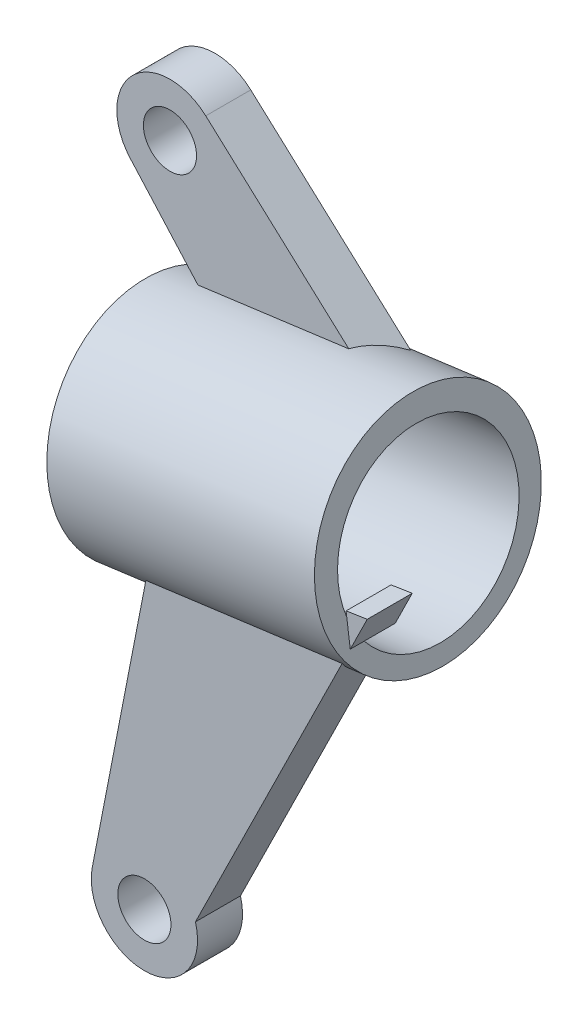
ISO-10303-21;
HEADER;
FILE_DESCRIPTION(('STEP AP214'),'2;1');
FILE_NAME('part.step','',(''),(''),'','','');
FILE_SCHEMA(('AUTOMOTIVE_DESIGN { 1 0 10303 214 1 1 1 1 }'));
ENDSEC;
DATA;
#1=APPLICATION_CONTEXT('core data for automotive mechanical design processes');
#2=APPLICATION_PROTOCOL_DEFINITION('international standard','automotive_design',2000,#1);
#3=PRODUCT_CONTEXT('',#1,'mechanical');
#4=PRODUCT('Part','Part','',(#3));
#5=PRODUCT_RELATED_PRODUCT_CATEGORY('part','',(#4));
#6=PRODUCT_DEFINITION_FORMATION('','',#4);
#7=PRODUCT_DEFINITION_CONTEXT('part definition',#1,'design');
#8=PRODUCT_DEFINITION('design','',#6,#7);
#9=PRODUCT_DEFINITION_SHAPE('','',#8);
#10=(LENGTH_UNIT() NAMED_UNIT(*) SI_UNIT(.MILLI.,.METRE.));
#11=(NAMED_UNIT(*) PLANE_ANGLE_UNIT() SI_UNIT($,.RADIAN.));
#12=(NAMED_UNIT(*) SI_UNIT($,.STERADIAN.) SOLID_ANGLE_UNIT());
#13=UNCERTAINTY_MEASURE_WITH_UNIT(LENGTH_MEASURE(1.E-05),#10,'distance_accuracy_value','');
#14=(GEOMETRIC_REPRESENTATION_CONTEXT(3) GLOBAL_UNCERTAINTY_ASSIGNED_CONTEXT((#13)) GLOBAL_UNIT_ASSIGNED_CONTEXT((#10,
#11,#12)) REPRESENTATION_CONTEXT('',''));
#15=CARTESIAN_POINT('',(0.,0.,0.));
#16=DIRECTION('',(0.,0.,1.));
#17=DIRECTION('',(1.,0.,0.));
#18=AXIS2_PLACEMENT_3D('',#15,#16,#17);
#19=CARTESIAN_POINT('',(81.8559870222354,35.5808890120292,0.));
#20=DIRECTION('',(-0.991210163402101,-0.132296681622706,0.));
#21=DIRECTION('',(0.132296681622706,-0.991210163402101,0.));
#22=AXIS2_PLACEMENT_3D('',#19,#20,#21);
#23=CYLINDRICAL_SURFACE('',#22,6.35);
#24=CARTESIAN_POINT('',(97.5954702150163,37.6816356283818,0.));
#25=DIRECTION('',(0.673198597584903,0.739461728698464,0.));
#26=DIRECTION('',(-0.739461728698464,0.673198597584903,0.));
#27=AXIS2_PLACEMENT_3D('',#24,#25,#26);
#28=ELLIPSE('',#27,8.29946427819877,6.35);
#29=CARTESIAN_POINT('',(91.5302630818505,43.2033398324599,-0.96935265499751));
#30=VERTEX_POINT('',#29);
#31=CARTESIAN_POINT('',(92.4807144852347,42.3380583351239,-3.50935265499751));
#32=VERTEX_POINT('',#31);
#33=EDGE_CURVE('E223',#30,#32,#28,.F.);
#34=ORIENTED_EDGE('',*,*,#33,.F.);
#35=DIRECTION('',(-0.991210163402101,-0.132296681622706,0.));
#36=VECTOR('',#35,1.);
#37=CARTESIAN_POINT('',(81.0257491284776,41.8013038269767,-0.96935265499751));
#38=LINE('',#37,#36);
#39=CARTESIAN_POINT('',(83.0122910436959,42.0664472980502,-0.96935265499751));
#40=VERTEX_POINT('',#39);
#41=EDGE_CURVE('E217',#30,#40,#38,.T.);
#42=ORIENTED_EDGE('',*,*,#41,.T.);
#43=CARTESIAN_POINT('',(88.0638021611543,36.4094452287929,0.));
#44=DIRECTION('',(0.745897281645723,0.666060992127238,0.));
#45=DIRECTION('',(-0.666060992127238,0.745897281645723,0.));
#46=AXIS2_PLACEMENT_3D('',#43,#44,#45);
#47=ELLIPSE('',#46,7.6740997130083,6.35);
#48=CARTESIAN_POINT('',(83.8038906915538,41.1799638791621,-3.50935265499751));
#49=VERTEX_POINT('',#48);
#50=EDGE_CURVE('E221',#40,#49,#47,.F.);
#51=ORIENTED_EDGE('',*,*,#50,.T.);
#52=DIRECTION('',(-0.991210163402101,-0.132296681622706,0.));
#53=VECTOR('',#52,1.);
#54=CARTESIAN_POINT('',(81.1558519846439,40.8265305239893,-3.50935265499751));
#55=LINE('',#54,#53);
#56=EDGE_CURVE('E188',#32,#49,#55,.T.);
#57=ORIENTED_EDGE('',*,*,#56,.F.);
#58=EDGE_LOOP('',(#34,#42,#51,#57));
#59=FACE_BOUND('',#58,.T.);
#60=CARTESIAN_POINT('',(96.9620299124834,37.5970904399592,0.));
#61=DIRECTION('',(-0.991210163402101,-0.132296681622706,0.));
#62=DIRECTION('',(0.132296681622706,-0.991210163402101,0.));
#63=AXIS2_PLACEMENT_3D('',#60,#61,#62);
#64=CIRCLE('',#63,6.35);
#65=CARTESIAN_POINT('',(97.8021138407876,31.3029059023559,0.));
#66=VERTEX_POINT('',#65);
#67=EDGE_CURVE('E226',#66,#66,#64,.T.);
#68=ORIENTED_EDGE('',*,*,#67,.T.);
#69=EDGE_LOOP('',(#68));
#70=FACE_BOUND('',#69,.T.);
#71=CARTESIAN_POINT('',(81.8559870222354,35.5808890120292,0.));
#72=DIRECTION('',(-0.991210163402101,-0.132296681622706,0.));
#73=DIRECTION('',(0.132296681622706,-0.991210163402101,0.));
#74=AXIS2_PLACEMENT_3D('',#71,#72,#73);
#75=CIRCLE('',#74,6.35);
#76=CARTESIAN_POINT('',(82.6960709505396,29.2867044744259,0.));
#77=VERTEX_POINT('',#76);
#78=EDGE_CURVE('E229',#77,#77,#75,.T.);
#79=ORIENTED_EDGE('',*,*,#78,.F.);
#80=EDGE_LOOP('',(#79));
#81=FACE_BOUND('',#80,.T.);
#82=DIRECTION('',(-0.991210163402101,-0.132296681622706,0.));
#83=VECTOR('',#82,1.);
#84=CARTESIAN_POINT('',(82.4035110732403,31.4786591041706,4.81605930161183));
#85=LINE('',#84,#83);
#86=CARTESIAN_POINT('',(96.9380255024266,33.4185787084843,4.81605930161183));
#87=VERTEX_POINT('',#86);
#88=CARTESIAN_POINT('',(85.8587282213821,31.9398264527943,4.81605930161183));
#89=VERTEX_POINT('',#88);
#90=EDGE_CURVE('E234',#87,#89,#85,.T.);
#91=ORIENTED_EDGE('',*,*,#90,.F.);
#92=CARTESIAN_POINT('',(99.1450004225356,37.888451208062,0.));
#93=DIRECTION('',(-0.896659559833335,0.44272071756299,0.));
#94=DIRECTION('',(-0.44272071756299,-0.896659559833335,0.));
#95=AXIS2_PLACEMENT_3D('',#92,#93,#94);
#96=ELLIPSE('',#95,7.64868943555648,6.35);
#97=CARTESIAN_POINT('',(95.9837658785708,31.4858794234739,2.27605930161183));
#98=VERTEX_POINT('',#97);
#99=EDGE_CURVE('E232',#98,#87,#96,.T.);
#100=ORIENTED_EDGE('',*,*,#99,.F.);
#101=DIRECTION('',(-0.991210163402101,-0.132296681622706,0.));
#102=VECTOR('',#101,1.);
#103=CARTESIAN_POINT('',(82.64025145946,29.7049224236243,2.27605930161183));
#104=LINE('',#103,#102);
#105=CARTESIAN_POINT('',(85.4978333573741,30.0863234791397,2.27605930161183));
#106=VERTEX_POINT('',#105);
#107=EDGE_CURVE('E236',#98,#106,#104,.T.);
#108=ORIENTED_EDGE('',*,*,#107,.T.);
#109=CARTESIAN_POINT('',(86.6933919688048,36.2265367724394,0.));
#110=DIRECTION('',(0.981566589582526,-0.191120459960021,0.));
#111=DIRECTION('',(-0.191120459960021,-0.981566589582525,0.));
#112=AXIS2_PLACEMENT_3D('',#109,#110,#111);
#113=ELLIPSE('',#112,6.70075661994534,6.35);
#114=EDGE_CURVE('E12',#89,#106,#113,.T.);
#115=ORIENTED_EDGE('',*,*,#114,.F.);
#116=EDGE_LOOP('',(#91,#100,#108,#115));
#117=FACE_BOUND('',#116,.T.);
#118=ADVANCED_FACE('F69',(#59,#70,#81,#117),#23,.T.);
#119=CARTESIAN_POINT('',(96.1219459841792,43.8912749775626,0.));
#120=DIRECTION('',(0.991210163402101,0.132296681622706,0.));
#121=DIRECTION('',(-0.132296681622706,0.991210163402101,0.));
#122=AXIS2_PLACEMENT_3D('',#119,#120,#121);
#123=PLANE('',#122);
#124=CARTESIAN_POINT('',(96.9868968674452,37.4107790511275,0.));
#125=DIRECTION('',(0.991210163402101,0.132296681622706,0.));
#126=DIRECTION('',(-0.132296681622706,0.991210163402101,0.));
#127=AXIS2_PLACEMENT_3D('',#124,#125,#126);
#128=CIRCLE('',#127,5.08);
#129=CARTESIAN_POINT('',(97.3959487011351,34.3460284471177,4.0306798846567));
#130=VERTEX_POINT('',#129);
#131=CARTESIAN_POINT('',(97.2007094584088,35.8088249383941,4.81605930161183));
#132=VERTEX_POINT('',#131);
#133=EDGE_CURVE('E158',#130,#132,#128,.T.);
#134=ORIENTED_EDGE('',*,*,#133,.F.);
#135=DIRECTION('',(0.,0.,1.));
#136=VECTOR('',#135,1.);
#137=CARTESIAN_POINT('',(97.3959487011351,34.3460284471176,0.));
#138=LINE('',#137,#136);
#139=CARTESIAN_POINT('',(97.3959487011351,34.3460284471176,4.81605930161183));
#140=VERTEX_POINT('',#139);
#141=EDGE_CURVE('E180',#130,#140,#138,.T.);
#142=ORIENTED_EDGE('',*,*,#141,.T.);
#143=DIRECTION('',(-0.132296681622706,0.991210163402101,0.));
#144=VECTOR('',#143,1.);
#145=CARTESIAN_POINT('',(96.1219459841792,43.8912749775626,4.81605930161183));
#146=LINE('',#145,#144);
#147=EDGE_CURVE('E77',#140,#132,#146,.T.);
#148=ORIENTED_EDGE('',*,*,#147,.T.);
#149=EDGE_LOOP('',(#134,#142,#148));
#150=FACE_BOUND('',#149,.T.);
#151=ORIENTED_EDGE('',*,*,#67,.F.);
#152=EDGE_LOOP('',(#151));
#153=FACE_BOUND('',#152,.T.);
#154=ADVANCED_FACE('F178',(#150,#153),#123,.T.);
#155=CARTESIAN_POINT('',(81.0159030939312,41.8750735496325,0.));
#156=DIRECTION('',(0.991210163402101,0.132296681622706,0.));
#157=DIRECTION('',(-0.132296681622706,0.991210163402101,0.));
#158=AXIS2_PLACEMENT_3D('',#155,#156,#157);
#159=PLANE('',#158);
#160=CARTESIAN_POINT('',(81.8808539771971,35.3945776231975,0.));
#161=DIRECTION('',(0.991210163402101,0.132296681622706,0.));
#162=DIRECTION('',(-0.132296681622706,0.991210163402101,0.));
#163=AXIS2_PLACEMENT_3D('',#160,#161,#162);
#164=CIRCLE('',#163,5.08);
#165=CARTESIAN_POINT('',(81.2087868345538,40.4299252532802,0.));
#166=VERTEX_POINT('',#165);
#167=EDGE_CURVE('E168',#166,#166,#164,.F.);
#168=ORIENTED_EDGE('',*,*,#167,.F.);
#169=EDGE_LOOP('',(#168));
#170=FACE_BOUND('',#169,.T.);
#171=ORIENTED_EDGE('',*,*,#78,.T.);
#172=EDGE_LOOP('',(#171));
#173=FACE_BOUND('',#172,.T.);
#174=ADVANCED_FACE('F276',(#170,#173),#159,.F.);
#175=CARTESIAN_POINT('',(81.4346560731477,48.3372748728967,-0.96935265499751));
#176=DIRECTION('',(0.,0.,-1.));
#177=DIRECTION('',(-1.,0.,0.));
#178=AXIS2_PLACEMENT_3D('',#175,#176,#177);
#179=PLANE('',#178);
#180=CARTESIAN_POINT('',(81.4346560731477,48.3372748728967,-0.96935265499751));
#181=DIRECTION('',(0.,0.,-1.));
#182=DIRECTION('',(-1.,0.,0.));
#183=AXIS2_PLACEMENT_3D('',#180,#181,#182);
#184=CIRCLE('',#183,1.5);
#185=CARTESIAN_POINT('',(79.9346560731477,48.3372748728967,-0.96935265499751));
#186=VERTEX_POINT('',#185);
#187=EDGE_CURVE('E206',#186,#186,#184,.T.);
#188=ORIENTED_EDGE('',*,*,#187,.T.);
#189=EDGE_LOOP('',(#188));
#190=FACE_BOUND('',#189,.T.);
#191=ORIENTED_EDGE('',*,*,#41,.F.);
#192=DIRECTION('',(0.739461728698464,-0.673198597584903,0.));
#193=VECTOR('',#192,1.);
#194=CARTESIAN_POINT('',(83.4542518659024,50.5556600589921,-0.96935265499751));
#195=LINE('',#194,#193);
#196=CARTESIAN_POINT('',(83.4542518659024,50.5556600589921,-0.96935265499751));
#197=VERTEX_POINT('',#196);
#198=EDGE_CURVE('E209',#197,#30,#195,.T.);
#199=ORIENTED_EDGE('',*,*,#198,.F.);
#200=CARTESIAN_POINT('',(81.4346560731477,48.3372748728967,-0.96935265499751));
#201=DIRECTION('',(0.,0.,-1.));
#202=DIRECTION('',(-1.,0.,0.));
#203=AXIS2_PLACEMENT_3D('',#200,#201,#202);
#204=CIRCLE('',#203,3.);
#205=CARTESIAN_POINT('',(79.1969642282105,46.339091896515,-0.96935265499751));
#206=VERTEX_POINT('',#205);
#207=EDGE_CURVE('E199',#206,#197,#204,.T.);
#208=ORIENTED_EDGE('',*,*,#207,.F.);
#209=DIRECTION('',(0.666060992127238,-0.745897281645723,0.));
#210=VECTOR('',#209,1.);
#211=CARTESIAN_POINT('',(79.1969642282105,46.339091896515,-0.96935265499751));
#212=LINE('',#211,#210);
#213=EDGE_CURVE('E194',#206,#40,#212,.T.);
#214=ORIENTED_EDGE('',*,*,#213,.T.);
#215=EDGE_LOOP('',(#191,#199,#208,#214));
#216=FACE_BOUND('',#215,.T.);
#217=ADVANCED_FACE('F279',(#190,#216),#179,.F.);
#218=CARTESIAN_POINT('',(81.4346560731477,48.3372748728967,-3.50935265499751));
#219=DIRECTION('',(0.,0.,-1.));
#220=DIRECTION('',(-1.,0.,0.));
#221=AXIS2_PLACEMENT_3D('',#218,#219,#220);
#222=PLANE('',#221);
#223=CARTESIAN_POINT('',(81.4346560731477,48.3372748728967,-3.50935265499751));
#224=DIRECTION('',(0.,0.,-1.));
#225=DIRECTION('',(-1.,0.,0.));
#226=AXIS2_PLACEMENT_3D('',#223,#224,#225);
#227=CIRCLE('',#226,1.5);
#228=CARTESIAN_POINT('',(79.9346560731477,48.3372748728967,-3.50935265499751));
#229=VERTEX_POINT('',#228);
#230=EDGE_CURVE('E214',#229,#229,#227,.T.);
#231=ORIENTED_EDGE('',*,*,#230,.F.);
#232=EDGE_LOOP('',(#231));
#233=FACE_BOUND('',#232,.T.);
#234=DIRECTION('',(0.739461728698464,-0.673198597584903,0.));
#235=VECTOR('',#234,1.);
#236=CARTESIAN_POINT('',(83.4542518659024,50.5556600589921,-3.50935265499751));
#237=LINE('',#236,#235);
#238=CARTESIAN_POINT('',(83.4542518659024,50.5556600589921,-3.50935265499751));
#239=VERTEX_POINT('',#238);
#240=EDGE_CURVE('E200',#239,#32,#237,.T.);
#241=ORIENTED_EDGE('',*,*,#240,.T.);
#242=ORIENTED_EDGE('',*,*,#56,.T.);
#243=DIRECTION('',(0.666060992127238,-0.745897281645723,0.));
#244=VECTOR('',#243,1.);
#245=CARTESIAN_POINT('',(79.1969642282105,46.339091896515,-3.50935265499751));
#246=LINE('',#245,#244);
#247=CARTESIAN_POINT('',(79.1969642282105,46.339091896515,-3.50935265499751));
#248=VERTEX_POINT('',#247);
#249=EDGE_CURVE('E196',#248,#49,#246,.T.);
#250=ORIENTED_EDGE('',*,*,#249,.F.);
#251=CARTESIAN_POINT('',(81.4346560731477,48.3372748728967,-3.50935265499751));
#252=DIRECTION('',(0.,0.,-1.));
#253=DIRECTION('',(-1.,0.,0.));
#254=AXIS2_PLACEMENT_3D('',#251,#252,#253);
#255=CIRCLE('',#254,3.);
#256=EDGE_CURVE('E203',#248,#239,#255,.T.);
#257=ORIENTED_EDGE('',*,*,#256,.T.);
#258=EDGE_LOOP('',(#241,#242,#250,#257));
#259=FACE_BOUND('',#258,.T.);
#260=ADVANCED_FACE('F348',(#233,#259),#222,.T.);
#261=CARTESIAN_POINT('',(81.4346560731477,48.3372748728967,-0.96935265499751));
#262=DIRECTION('',(0.,0.,-1.));
#263=DIRECTION('',(-1.,0.,0.));
#264=AXIS2_PLACEMENT_3D('',#261,#262,#263);
#265=CYLINDRICAL_SURFACE('',#264,3.);
#266=ORIENTED_EDGE('',*,*,#256,.F.);
#267=DIRECTION('',(0.,0.,-1.));
#268=VECTOR('',#267,1.);
#269=CARTESIAN_POINT('',(79.1969642282105,46.339091896515,-0.96935265499751));
#270=LINE('',#269,#268);
#271=EDGE_CURVE('E191',#206,#248,#270,.T.);
#272=ORIENTED_EDGE('',*,*,#271,.F.);
#273=ORIENTED_EDGE('',*,*,#207,.T.);
#274=DIRECTION('',(0.,0.,-1.));
#275=VECTOR('',#274,1.);
#276=CARTESIAN_POINT('',(83.4542518659024,50.5556600589921,-0.96935265499751));
#277=LINE('',#276,#275);
#278=EDGE_CURVE('E192',#197,#239,#277,.T.);
#279=ORIENTED_EDGE('',*,*,#278,.T.);
#280=EDGE_LOOP('',(#266,#272,#273,#279));
#281=FACE_BOUND('',#280,.T.);
#282=ADVANCED_FACE('F71',(#281),#265,.T.);
#283=CARTESIAN_POINT('',(79.1969642282105,46.339091896515,-0.96935265499751));
#284=DIRECTION('',(0.745897281645723,0.666060992127238,0.));
#285=DIRECTION('',(-0.666060992127238,0.745897281645723,0.));
#286=AXIS2_PLACEMENT_3D('',#283,#284,#285);
#287=PLANE('',#286);
#288=ORIENTED_EDGE('',*,*,#50,.F.);
#289=ORIENTED_EDGE('',*,*,#213,.F.);
#290=ORIENTED_EDGE('',*,*,#271,.T.);
#291=ORIENTED_EDGE('',*,*,#249,.T.);
#292=EDGE_LOOP('',(#288,#289,#290,#291));
#293=FACE_BOUND('',#292,.T.);
#294=ADVANCED_FACE('F353',(#293),#287,.F.);
#295=CARTESIAN_POINT('',(83.4542518659024,50.5556600589921,-0.96935265499751));
#296=DIRECTION('',(0.673198597584903,0.739461728698464,0.));
#297=DIRECTION('',(-0.739461728698464,0.673198597584903,0.));
#298=AXIS2_PLACEMENT_3D('',#295,#296,#297);
#299=PLANE('',#298);
#300=ORIENTED_EDGE('',*,*,#198,.T.);
#301=ORIENTED_EDGE('',*,*,#33,.T.);
#302=ORIENTED_EDGE('',*,*,#240,.F.);
#303=ORIENTED_EDGE('',*,*,#278,.F.);
#304=EDGE_LOOP('',(#300,#301,#302,#303));
#305=FACE_BOUND('',#304,.T.);
#306=ADVANCED_FACE('F344',(#305),#299,.T.);
#307=CARTESIAN_POINT('',(81.4346560731477,48.3372748728967,-0.96935265499751));
#308=DIRECTION('',(0.,0.,-1.));
#309=DIRECTION('',(-1.,0.,0.));
#310=AXIS2_PLACEMENT_3D('',#307,#308,#309);
#311=CYLINDRICAL_SURFACE('',#310,1.5);
#312=ORIENTED_EDGE('',*,*,#187,.F.);
#313=EDGE_LOOP('',(#312));
#314=FACE_BOUND('',#313,.T.);
#315=ORIENTED_EDGE('',*,*,#230,.T.);
#316=EDGE_LOOP('',(#315));
#317=FACE_BOUND('',#316,.T.);
#318=ADVANCED_FACE('F327',(#314,#317),#311,.F.);
#319=CARTESIAN_POINT('',(85.7754030229592,15.8149739305322,4.81605930161183));
#320=DIRECTION('',(0.,0.,-1.));
#321=DIRECTION('',(-1.,0.,0.));
#322=AXIS2_PLACEMENT_3D('',#319,#320,#321);
#323=PLANE('',#322);
#324=ORIENTED_EDGE('',*,*,#147,.F.);
#325=DIRECTION('',(0.44272071756299,0.896659559833336,0.));
#326=VECTOR('',#325,1.);
#327=CARTESIAN_POINT('',(88.6575079489088,16.6477231099475,4.81605930161183));
#328=LINE('',#327,#326);
#329=CARTESIAN_POINT('',(98.3552833466001,36.2890063715992,4.81605930161183));
#330=VERTEX_POINT('',#329);
#331=EDGE_CURVE('E261',#140,#330,#328,.T.);
#332=ORIENTED_EDGE('',*,*,#331,.T.);
#333=DIRECTION('',(-0.987971318041129,-0.154637235904144,0.));
#334=VECTOR('',#333,1.);
#335=CARTESIAN_POINT('',(98.3552833466001,36.2890063715992,4.81605930161183));
#336=LINE('',#335,#334);
#337=CARTESIAN_POINT('',(97.1615574761779,36.1021644404029,4.81605930161183));
#338=VERTEX_POINT('',#337);
#339=EDGE_CURVE('E175',#330,#338,#336,.T.);
#340=ORIENTED_EDGE('',*,*,#339,.T.);
#341=DIRECTION('',(0.132296681622706,-0.991210163402101,0.));
#342=VECTOR('',#341,1.);
#343=CARTESIAN_POINT('',(99.6226090056866,17.6631585728014,4.81605930161183));
#344=LINE('',#343,#342);
#345=EDGE_CURVE('E91',#338,#132,#344,.T.);
#346=ORIENTED_EDGE('',*,*,#345,.T.);
#347=EDGE_LOOP('',(#324,#332,#340,#346));
#348=FACE_BOUND('',#347,.T.);
#349=ADVANCED_FACE('F172',(#348),#323,.F.);
#350=CARTESIAN_POINT('',(85.7754030229592,15.8149739305322,2.27605930161183));
#351=DIRECTION('',(0.,0.,-1.));
#352=DIRECTION('',(-1.,0.,0.));
#353=AXIS2_PLACEMENT_3D('',#350,#351,#352);
#354=PLANE('',#353);
#355=DIRECTION('',(0.44272071756299,0.896659559833336,0.));
#356=VECTOR('',#355,1.);
#357=CARTESIAN_POINT('',(88.6575079489088,16.6477231099475,2.27605930161183));
#358=LINE('',#357,#356);
#359=CARTESIAN_POINT('',(97.3959487011351,34.3460284471176,2.27605930161183));
#360=VERTEX_POINT('',#359);
#361=CARTESIAN_POINT('',(98.3552833466001,36.2890063715992,2.27605930161183));
#362=VERTEX_POINT('',#361);
#363=EDGE_CURVE('E251',#360,#362,#358,.T.);
#364=ORIENTED_EDGE('',*,*,#363,.F.);
#365=DIRECTION('',(-0.132296681622706,0.991210163402101,0.));
#366=VECTOR('',#365,1.);
#367=CARTESIAN_POINT('',(96.1219459841792,43.8912749775626,2.27605930161183));
#368=LINE('',#367,#366);
#369=CARTESIAN_POINT('',(97.1615574761779,36.1021644404029,2.27605930161183));
#370=VERTEX_POINT('',#369);
#371=EDGE_CURVE('E185',#360,#370,#368,.T.);
#372=ORIENTED_EDGE('',*,*,#371,.T.);
#373=DIRECTION('',(-0.987971318041129,-0.154637235904144,0.));
#374=VECTOR('',#373,1.);
#375=CARTESIAN_POINT('',(98.3552833466001,36.2890063715992,2.27605930161183));
#376=LINE('',#375,#374);
#377=EDGE_CURVE('E255',#362,#370,#376,.T.);
#378=ORIENTED_EDGE('',*,*,#377,.F.);
#379=EDGE_LOOP('',(#364,#372,#378));
#380=FACE_BOUND('',#379,.T.);
#381=ADVANCED_FACE('F308',(#380),#354,.T.);
#382=CARTESIAN_POINT('',(88.6575079489088,16.6477231099475,4.81605930161183));
#383=DIRECTION('',(-0.896659559833335,0.44272071756299,0.));
#384=DIRECTION('',(-0.44272071756299,-0.896659559833335,0.));
#385=AXIS2_PLACEMENT_3D('',#382,#383,#384);
#386=PLANE('',#385);
#387=EDGE_CURVE('E167',#360,#130,#138,.T.);
#388=ORIENTED_EDGE('',*,*,#387,.F.);
#389=ORIENTED_EDGE('',*,*,#363,.T.);
#390=DIRECTION('',(0.,0.,-1.));
#391=VECTOR('',#390,1.);
#392=CARTESIAN_POINT('',(98.3552833466001,36.2890063715992,4.81605930161183));
#393=LINE('',#392,#391);
#394=EDGE_CURVE('E244',#330,#362,#393,.T.);
#395=ORIENTED_EDGE('',*,*,#394,.F.);
#396=ORIENTED_EDGE('',*,*,#331,.F.);
#397=ORIENTED_EDGE('',*,*,#141,.F.);
#398=EDGE_LOOP('',(#388,#389,#395,#396,#397));
#399=FACE_BOUND('',#398,.T.);
#400=ADVANCED_FACE('F319',(#399),#386,.F.);
#401=CARTESIAN_POINT('',(98.3552833466001,36.2890063715992,4.81605930161183));
#402=DIRECTION('',(0.154637235904144,-0.987971318041129,0.));
#403=DIRECTION('',(0.987971318041129,0.154637235904144,0.));
#404=AXIS2_PLACEMENT_3D('',#401,#402,#403);
#405=PLANE('',#404);
#406=DIRECTION('',(0.,0.,-1.));
#407=VECTOR('',#406,1.);
#408=CARTESIAN_POINT('',(97.1615574761779,36.1021644404029,0.));
#409=LINE('',#408,#407);
#410=EDGE_CURVE('E181',#338,#370,#409,.T.);
#411=ORIENTED_EDGE('',*,*,#410,.F.);
#412=ORIENTED_EDGE('',*,*,#339,.F.);
#413=ORIENTED_EDGE('',*,*,#394,.T.);
#414=ORIENTED_EDGE('',*,*,#377,.T.);
#415=EDGE_LOOP('',(#411,#412,#413,#414));
#416=FACE_BOUND('',#415,.T.);
#417=ADVANCED_FACE('F325',(#416),#405,.F.);
#418=CARTESIAN_POINT('',(88.6575079489088,16.6477231099475,2.27605930161183));
#419=VERTEX_POINT('',#418);
#420=EDGE_CURVE('E248',#419,#98,#358,.T.);
#421=ORIENTED_EDGE('',*,*,#420,.T.);
#422=ORIENTED_EDGE('',*,*,#99,.T.);
#423=CARTESIAN_POINT('',(88.6575079489088,16.6477231099475,4.81605930161183));
#424=VERTEX_POINT('',#423);
#425=EDGE_CURVE('E247',#424,#87,#328,.T.);
#426=ORIENTED_EDGE('',*,*,#425,.F.);
#427=DIRECTION('',(0.,0.,-1.));
#428=VECTOR('',#427,1.);
#429=CARTESIAN_POINT('',(88.6575079489088,16.6477231099475,4.81605930161183));
#430=LINE('',#429,#428);
#431=EDGE_CURVE('E242',#424,#419,#430,.T.);
#432=ORIENTED_EDGE('',*,*,#431,.T.);
#433=EDGE_LOOP('',(#421,#422,#426,#432));
#434=FACE_BOUND('',#433,.T.);
#435=ADVANCED_FACE('F303',(#434),#386,.F.);
#436=CARTESIAN_POINT('',(85.7754030229592,15.8149739305322,4.81605930161183));
#437=DIRECTION('',(0.,0.,-1.));
#438=DIRECTION('',(-1.,0.,0.));
#439=AXIS2_PLACEMENT_3D('',#436,#437,#438);
#440=CIRCLE('',#439,1.5);
#441=CARTESIAN_POINT('',(84.2754030229592,15.8149739305322,4.81605930161183));
#442=VERTEX_POINT('',#441);
#443=EDGE_CURVE('E258',#442,#442,#440,.T.);
#444=ORIENTED_EDGE('',*,*,#443,.T.);
#445=EDGE_LOOP('',(#444));
#446=FACE_BOUND('',#445,.T.);
#447=ORIENTED_EDGE('',*,*,#425,.T.);
#448=ORIENTED_EDGE('',*,*,#90,.T.);
#449=DIRECTION('',(-0.191120459960021,-0.981566589582525,0.));
#450=VECTOR('',#449,1.);
#451=CARTESIAN_POINT('',(86.3393587654591,34.4082742793514,4.81605930161183));
#452=LINE('',#451,#450);
#453=CARTESIAN_POINT('',(82.8307032542116,16.3883353104123,4.81605930161183));
#454=VERTEX_POINT('',#453);
#455=EDGE_CURVE('E265',#89,#454,#452,.T.);
#456=ORIENTED_EDGE('',*,*,#455,.T.);
#457=CARTESIAN_POINT('',(85.7754030229592,15.8149739305322,4.81605930161183));
#458=DIRECTION('',(0.,0.,-1.));
#459=DIRECTION('',(-1.,0.,0.));
#460=AXIS2_PLACEMENT_3D('',#457,#458,#459);
#461=CIRCLE('',#460,3.);
#462=EDGE_CURVE('E262',#424,#454,#461,.T.);
#463=ORIENTED_EDGE('',*,*,#462,.F.);
#464=EDGE_LOOP('',(#447,#448,#456,#463));
#465=FACE_BOUND('',#464,.T.);
#466=ADVANCED_FACE('F292',(#446,#465),#323,.F.);
#467=CARTESIAN_POINT('',(85.7754030229592,15.8149739305322,2.27605930161183));
#468=DIRECTION('',(0.,0.,-1.));
#469=DIRECTION('',(-1.,0.,0.));
#470=AXIS2_PLACEMENT_3D('',#467,#468,#469);
#471=CIRCLE('',#470,1.5);
#472=CARTESIAN_POINT('',(84.2754030229592,15.8149739305322,2.27605930161183));
#473=VERTEX_POINT('',#472);
#474=EDGE_CURVE('E176',#473,#473,#471,.T.);
#475=ORIENTED_EDGE('',*,*,#474,.F.);
#476=EDGE_LOOP('',(#475));
#477=FACE_BOUND('',#476,.T.);
#478=ORIENTED_EDGE('',*,*,#107,.F.);
#479=ORIENTED_EDGE('',*,*,#420,.F.);
#480=CARTESIAN_POINT('',(85.7754030229592,15.8149739305322,2.27605930161183));
#481=DIRECTION('',(0.,0.,-1.));
#482=DIRECTION('',(-1.,0.,0.));
#483=AXIS2_PLACEMENT_3D('',#480,#481,#482);
#484=CIRCLE('',#483,3.);
#485=CARTESIAN_POINT('',(82.8307032542116,16.3883353104123,2.27605930161183));
#486=VERTEX_POINT('',#485);
#487=EDGE_CURVE('E252',#419,#486,#484,.T.);
#488=ORIENTED_EDGE('',*,*,#487,.T.);
#489=DIRECTION('',(-0.191120459960021,-0.981566589582525,0.));
#490=VECTOR('',#489,1.);
#491=CARTESIAN_POINT('',(86.3393587654591,34.4082742793514,2.27605930161183));
#492=LINE('',#491,#490);
#493=EDGE_CURVE('E84',#106,#486,#492,.T.);
#494=ORIENTED_EDGE('',*,*,#493,.F.);
#495=EDGE_LOOP('',(#478,#479,#488,#494));
#496=FACE_BOUND('',#495,.T.);
#497=ADVANCED_FACE('F304',(#477,#496),#354,.T.);
#498=CARTESIAN_POINT('',(86.3393587654591,34.4082742793514,4.81605930161183));
#499=DIRECTION('',(0.981566589582526,-0.191120459960021,0.));
#500=DIRECTION('',(0.191120459960021,0.981566589582525,0.));
#501=AXIS2_PLACEMENT_3D('',#498,#499,#500);
#502=PLANE('',#501);
#503=ORIENTED_EDGE('',*,*,#455,.F.);
#504=ORIENTED_EDGE('',*,*,#114,.T.);
#505=ORIENTED_EDGE('',*,*,#493,.T.);
#506=DIRECTION('',(0.,0.,-1.));
#507=VECTOR('',#506,1.);
#508=CARTESIAN_POINT('',(82.8307032542116,16.3883353104123,4.81605930161183));
#509=LINE('',#508,#507);
#510=EDGE_CURVE('E239',#454,#486,#509,.T.);
#511=ORIENTED_EDGE('',*,*,#510,.F.);
#512=EDGE_LOOP('',(#503,#504,#505,#511));
#513=FACE_BOUND('',#512,.T.);
#514=ADVANCED_FACE('F297',(#513),#502,.F.);
#515=CARTESIAN_POINT('',(85.7754030229592,15.8149739305322,4.81605930161183));
#516=DIRECTION('',(0.,0.,-1.));
#517=DIRECTION('',(-1.,0.,0.));
#518=AXIS2_PLACEMENT_3D('',#515,#516,#517);
#519=CYLINDRICAL_SURFACE('',#518,3.);
#520=ORIENTED_EDGE('',*,*,#487,.F.);
#521=ORIENTED_EDGE('',*,*,#431,.F.);
#522=ORIENTED_EDGE('',*,*,#462,.T.);
#523=ORIENTED_EDGE('',*,*,#510,.T.);
#524=EDGE_LOOP('',(#520,#521,#522,#523));
#525=FACE_BOUND('',#524,.T.);
#526=ADVANCED_FACE('F300',(#525),#519,.T.);
#527=CARTESIAN_POINT('',(85.7754030229592,15.8149739305322,4.81605930161183));
#528=DIRECTION('',(0.,0.,-1.));
#529=DIRECTION('',(-1.,0.,0.));
#530=AXIS2_PLACEMENT_3D('',#527,#528,#529);
#531=CYLINDRICAL_SURFACE('',#530,1.5);
#532=ORIENTED_EDGE('',*,*,#443,.F.);
#533=EDGE_LOOP('',(#532));
#534=FACE_BOUND('',#533,.T.);
#535=ORIENTED_EDGE('',*,*,#474,.T.);
#536=EDGE_LOOP('',(#535));
#537=FACE_BOUND('',#536,.T.);
#538=ADVANCED_FACE('F444',(#534,#537),#531,.F.);
#539=CARTESIAN_POINT('',(96.9868968674452,37.4107790511275,0.));
#540=DIRECTION('',(0.991210163402101,0.132296681622706,0.));
#541=DIRECTION('',(-0.132296681622706,0.991210163402101,0.));
#542=AXIS2_PLACEMENT_3D('',#539,#540,#541);
#543=PLANE('',#542);
#544=EDGE_CURVE('E160',#132,#130,#128,.T.);
#545=ORIENTED_EDGE('',*,*,#544,.F.);
#546=ORIENTED_EDGE('',*,*,#345,.F.);
#547=ORIENTED_EDGE('',*,*,#410,.T.);
#548=ORIENTED_EDGE('',*,*,#371,.F.);
#549=ORIENTED_EDGE('',*,*,#387,.T.);
#550=EDGE_LOOP('',(#545,#546,#547,#548,#549));
#551=FACE_BOUND('',#550,.T.);
#552=ADVANCED_FACE('F165',(#551),#543,.F.);
#553=CARTESIAN_POINT('',(67.6387401577448,33.4936846872944,0.));
#554=DIRECTION('',(0.991210163402101,0.132296681622706,0.));
#555=DIRECTION('',(-0.132296681622706,0.991210163402101,0.));
#556=AXIS2_PLACEMENT_3D('',#553,#554,#555);
#557=CYLINDRICAL_SURFACE('',#556,5.08);
#558=ORIENTED_EDGE('',*,*,#167,.T.);
#559=EDGE_LOOP('',(#558));
#560=FACE_BOUND('',#559,.T.);
#561=ORIENTED_EDGE('',*,*,#544,.T.);
#562=ORIENTED_EDGE('',*,*,#133,.T.);
#563=EDGE_LOOP('',(#561,#562));
#564=FACE_BOUND('',#563,.T.);
#565=ADVANCED_FACE('F159',(#560,#564),#557,.F.);
#566=CLOSED_SHELL('',(#118,#154,#174,#217,#260,#282,#294,#306,#318,#349,#381,#400,#417,#435,
#466,#497,#514,#526,#538,#552,#565));
#567=MANIFOLD_SOLID_BREP('B2',#566);
#568=ADVANCED_BREP_SHAPE_REPRESENTATION('',(#18,#567),#14);
#569=SHAPE_DEFINITION_REPRESENTATION(#9,#568);
ENDSEC;
END-ISO-10303-21;
